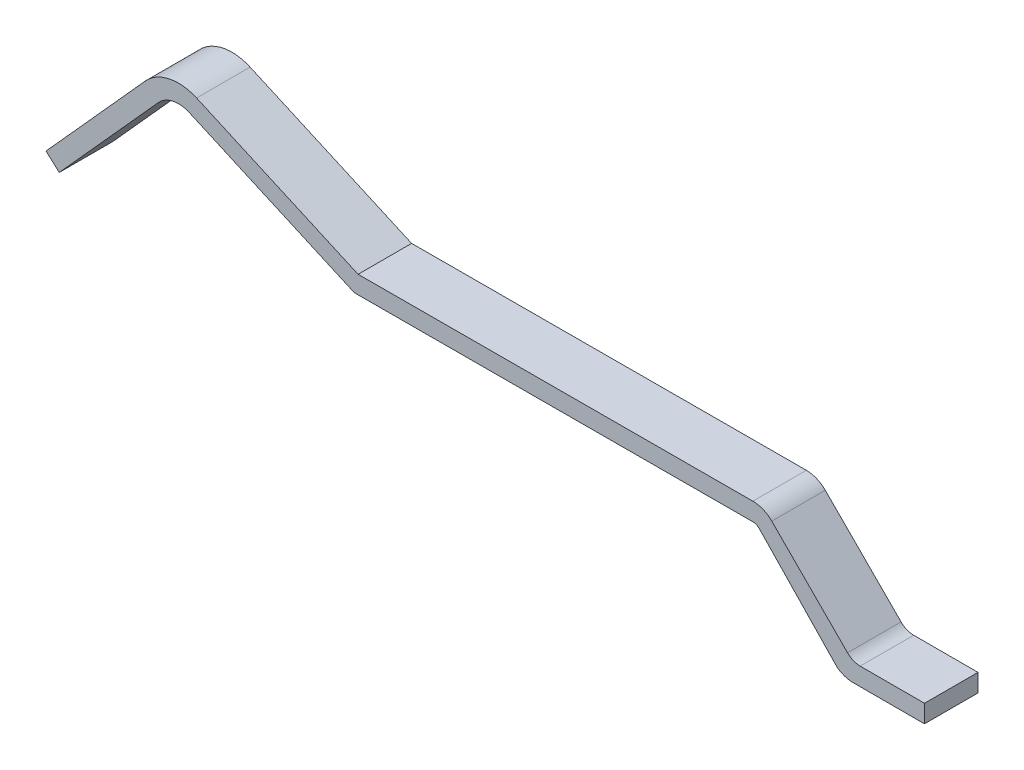
ISO-10303-21;
HEADER;
FILE_DESCRIPTION(('STEP AP214'),'2;1');
FILE_NAME('part.step','',(''),(''),'','','');
FILE_SCHEMA(('AUTOMOTIVE_DESIGN { 1 0 10303 214 1 1 1 1 }'));
ENDSEC;
DATA;
#1=APPLICATION_CONTEXT('core data for automotive mechanical design processes');
#2=APPLICATION_PROTOCOL_DEFINITION('international standard','automotive_design',2000,#1);
#3=PRODUCT_CONTEXT('',#1,'mechanical');
#4=PRODUCT('Part','Part','',(#3));
#5=PRODUCT_RELATED_PRODUCT_CATEGORY('part','',(#4));
#6=PRODUCT_DEFINITION_FORMATION('','',#4);
#7=PRODUCT_DEFINITION_CONTEXT('part definition',#1,'design');
#8=PRODUCT_DEFINITION('design','',#6,#7);
#9=PRODUCT_DEFINITION_SHAPE('','',#8);
#10=(LENGTH_UNIT() NAMED_UNIT(*) SI_UNIT(.MILLI.,.METRE.));
#11=(NAMED_UNIT(*) PLANE_ANGLE_UNIT() SI_UNIT($,.RADIAN.));
#12=(NAMED_UNIT(*) SI_UNIT($,.STERADIAN.) SOLID_ANGLE_UNIT());
#13=UNCERTAINTY_MEASURE_WITH_UNIT(LENGTH_MEASURE(1.E-05),#10,'distance_accuracy_value','');
#14=(GEOMETRIC_REPRESENTATION_CONTEXT(3) GLOBAL_UNCERTAINTY_ASSIGNED_CONTEXT((#13)) GLOBAL_UNIT_ASSIGNED_CONTEXT((#10,
#11,#12)) REPRESENTATION_CONTEXT('',''));
#15=CARTESIAN_POINT('',(0.,0.,0.));
#16=DIRECTION('',(0.,0.,1.));
#17=DIRECTION('',(1.,0.,0.));
#18=AXIS2_PLACEMENT_3D('',#15,#16,#17);
#19=CARTESIAN_POINT('',(18.078994901728,0.200000000000047,0.3));
#20=DIRECTION('',(0.,-1.,0.));
#21=DIRECTION('',(1.,0.,0.));
#22=AXIS2_PLACEMENT_3D('',#19,#20,#21);
#23=PLANE('',#22);
#24=DIRECTION('',(-1.,0.,0.));
#25=VECTOR('',#24,1.);
#26=CARTESIAN_POINT('',(18.078994901728,0.200000000000047,-0.3));
#27=LINE('',#26,#25);
#28=CARTESIAN_POINT('',(18.8,0.200000000000047,-0.3));
#29=VERTEX_POINT('',#28);
#30=CARTESIAN_POINT('',(18.078994901728,0.200000000000047,-0.3));
#31=VERTEX_POINT('',#30);
#32=EDGE_CURVE('E190',#29,#31,#27,.T.);
#33=ORIENTED_EDGE('',*,*,#32,.T.);
#34=DIRECTION('',(0.,0.,-1.));
#35=VECTOR('',#34,1.);
#36=CARTESIAN_POINT('',(18.078994901728,0.200000000000047,0.3));
#37=LINE('',#36,#35);
#38=CARTESIAN_POINT('',(18.078994901728,0.200000000000047,0.3));
#39=VERTEX_POINT('',#38);
#40=EDGE_CURVE('E11',#39,#31,#37,.T.);
#41=ORIENTED_EDGE('',*,*,#40,.F.);
#42=DIRECTION('',(-1.,0.,0.));
#43=VECTOR('',#42,1.);
#44=CARTESIAN_POINT('',(18.078994901728,0.200000000000047,0.3));
#45=LINE('',#44,#43);
#46=CARTESIAN_POINT('',(18.8,0.200000000000047,0.3));
#47=VERTEX_POINT('',#46);
#48=EDGE_CURVE('E224',#47,#39,#45,.T.);
#49=ORIENTED_EDGE('',*,*,#48,.F.);
#50=DIRECTION('',(0.,0.,-1.));
#51=VECTOR('',#50,1.);
#52=CARTESIAN_POINT('',(18.8,0.200000000000047,0.3));
#53=LINE('',#52,#51);
#54=EDGE_CURVE('E186',#47,#29,#53,.T.);
#55=ORIENTED_EDGE('',*,*,#54,.T.);
#56=EDGE_LOOP('',(#33,#41,#49,#55));
#57=FACE_BOUND('',#56,.T.);
#58=ADVANCED_FACE('F34',(#57),#23,.F.);
#59=CARTESIAN_POINT('',(18.078994901728,0.400000000000047,0.3));
#60=DIRECTION('',(0.,0.,-1.));
#61=DIRECTION('',(-1.,0.,0.));
#62=AXIS2_PLACEMENT_3D('',#59,#60,#61);
#63=CYLINDRICAL_SURFACE('',#62,0.2);
#64=CARTESIAN_POINT('',(18.078994901728,0.400000000000047,-0.3));
#65=DIRECTION('',(0.,0.,-1.));
#66=DIRECTION('',(1.,0.,0.));
#67=AXIS2_PLACEMENT_3D('',#64,#65,#66);
#68=CIRCLE('',#67,0.2);
#69=CARTESIAN_POINT('',(17.9372543641692,0.258898547092701,-0.3));
#70=VERTEX_POINT('',#69);
#71=EDGE_CURVE('E193',#31,#70,#68,.T.);
#72=ORIENTED_EDGE('',*,*,#71,.T.);
#73=DIRECTION('',(0.,0.,-1.));
#74=VECTOR('',#73,1.);
#75=CARTESIAN_POINT('',(17.9372543641692,0.258898547092701,0.3));
#76=LINE('',#75,#74);
#77=CARTESIAN_POINT('',(17.9372543641692,0.258898547092701,0.3));
#78=VERTEX_POINT('',#77);
#79=EDGE_CURVE('E42',#78,#70,#76,.T.);
#80=ORIENTED_EDGE('',*,*,#79,.F.);
#81=CARTESIAN_POINT('',(18.078994901728,0.400000000000047,0.3));
#82=DIRECTION('',(0.,0.,-1.));
#83=DIRECTION('',(1.,0.,0.));
#84=AXIS2_PLACEMENT_3D('',#81,#82,#83);
#85=CIRCLE('',#84,0.2);
#86=EDGE_CURVE('E123',#39,#78,#85,.T.);
#87=ORIENTED_EDGE('',*,*,#86,.F.);
#88=ORIENTED_EDGE('',*,*,#40,.T.);
#89=EDGE_LOOP('',(#72,#80,#87,#88));
#90=FACE_BOUND('',#89,.T.);
#91=ADVANCED_FACE('F332',(#90),#63,.F.);
#92=CARTESIAN_POINT('',(17.0878679656441,1.11213203435578,0.3));
#93=DIRECTION('',(-0.708702687793621,-0.705507264536729,0.));
#94=DIRECTION('',(0.705507264536729,-0.708702687793621,0.));
#95=AXIS2_PLACEMENT_3D('',#92,#93,#94);
#96=PLANE('',#95);
#97=DIRECTION('',(-0.705507264536729,0.708702687793621,0.));
#98=VECTOR('',#97,1.);
#99=CARTESIAN_POINT('',(17.0878679656441,1.11213203435578,-0.3));
#100=LINE('',#99,#98);
#101=CARTESIAN_POINT('',(17.0878679656441,1.11213203435578,-0.3));
#102=VERTEX_POINT('',#101);
#103=EDGE_CURVE('E195',#70,#102,#100,.T.);
#104=ORIENTED_EDGE('',*,*,#103,.T.);
#105=DIRECTION('',(0.,0.,-1.));
#106=VECTOR('',#105,1.);
#107=CARTESIAN_POINT('',(17.0878679656441,1.11213203435578,0.3));
#108=LINE('',#107,#106);
#109=CARTESIAN_POINT('',(17.0878679656441,1.11213203435578,0.3));
#110=VERTEX_POINT('',#109);
#111=EDGE_CURVE('E261',#110,#102,#108,.T.);
#112=ORIENTED_EDGE('',*,*,#111,.F.);
#113=DIRECTION('',(-0.705507264536729,0.708702687793621,0.));
#114=VECTOR('',#113,1.);
#115=CARTESIAN_POINT('',(17.0878679656441,1.11213203435578,0.3));
#116=LINE('',#115,#114);
#117=EDGE_CURVE('E269',#78,#110,#116,.T.);
#118=ORIENTED_EDGE('',*,*,#117,.F.);
#119=ORIENTED_EDGE('',*,*,#79,.T.);
#120=EDGE_LOOP('',(#104,#112,#118,#119));
#121=FACE_BOUND('',#120,.T.);
#122=ADVANCED_FACE('F267',(#121),#96,.F.);
#123=CARTESIAN_POINT('',(16.8764101070644,0.901627604302296,0.3));
#124=DIRECTION('',(0.,0.,-1.));
#125=DIRECTION('',(-1.,0.,0.));
#126=AXIS2_PLACEMENT_3D('',#123,#124,#125);
#127=CYLINDRICAL_SURFACE('',#126,0.298373157350417);
#128=CARTESIAN_POINT('',(16.8764101070644,0.901627604302296,-0.3));
#129=DIRECTION('',(0.,0.,1.));
#130=DIRECTION('',(1.,0.,0.));
#131=AXIS2_PLACEMENT_3D('',#128,#129,#130);
#132=CIRCLE('',#131,0.298373157350417);
#133=CARTESIAN_POINT('',(16.8757359312881,1.19999999999982,-0.3));
#134=VERTEX_POINT('',#133);
#135=EDGE_CURVE('E197',#102,#134,#132,.T.);
#136=ORIENTED_EDGE('',*,*,#135,.T.);
#137=DIRECTION('',(0.,0.,-1.));
#138=VECTOR('',#137,1.);
#139=CARTESIAN_POINT('',(16.8757359312881,1.19999999999982,0.3));
#140=LINE('',#139,#138);
#141=CARTESIAN_POINT('',(16.8757359312881,1.19999999999982,0.3));
#142=VERTEX_POINT('',#141);
#143=EDGE_CURVE('E258',#142,#134,#140,.T.);
#144=ORIENTED_EDGE('',*,*,#143,.F.);
#145=CARTESIAN_POINT('',(16.8764101070644,0.901627604302296,0.3));
#146=DIRECTION('',(0.,0.,1.));
#147=DIRECTION('',(1.,0.,0.));
#148=AXIS2_PLACEMENT_3D('',#145,#146,#147);
#149=CIRCLE('',#148,0.298373157350417);
#150=EDGE_CURVE('E287',#110,#142,#149,.T.);
#151=ORIENTED_EDGE('',*,*,#150,.F.);
#152=ORIENTED_EDGE('',*,*,#111,.T.);
#153=EDGE_LOOP('',(#136,#144,#151,#152));
#154=FACE_BOUND('',#153,.T.);
#155=ADVANCED_FACE('F278',(#154),#127,.T.);
#156=CARTESIAN_POINT('',(12.4499999999999,1.19000000000005,0.3));
#157=DIRECTION('',(0.00225950545359492,-0.999997447314295,0.));
#158=DIRECTION('',(0.999997447314295,0.00225950545359492,0.));
#159=AXIS2_PLACEMENT_3D('',#156,#157,#158);
#160=PLANE('',#159);
#161=DIRECTION('',(-0.999997447314295,-0.00225950545359492,0.));
#162=VECTOR('',#161,1.);
#163=CARTESIAN_POINT('',(12.4499999999999,1.19000000000005,-0.3));
#164=LINE('',#163,#162);
#165=CARTESIAN_POINT('',(12.4499999999999,1.19000000000005,-0.3));
#166=VERTEX_POINT('',#165);
#167=EDGE_CURVE('E199',#134,#166,#164,.T.);
#168=ORIENTED_EDGE('',*,*,#167,.T.);
#169=DIRECTION('',(0.,0.,-1.));
#170=VECTOR('',#169,1.);
#171=CARTESIAN_POINT('',(12.4499999999999,1.19000000000005,0.3));
#172=LINE('',#171,#170);
#173=CARTESIAN_POINT('',(12.4499999999999,1.19000000000005,0.3));
#174=VERTEX_POINT('',#173);
#175=EDGE_CURVE('E255',#174,#166,#172,.T.);
#176=ORIENTED_EDGE('',*,*,#175,.F.);
#177=DIRECTION('',(-0.999997447314295,-0.00225950545359492,0.));
#178=VECTOR('',#177,1.);
#179=CARTESIAN_POINT('',(12.4499999999999,1.19000000000005,0.3));
#180=LINE('',#179,#178);
#181=EDGE_CURVE('E284',#142,#174,#180,.T.);
#182=ORIENTED_EDGE('',*,*,#181,.F.);
#183=ORIENTED_EDGE('',*,*,#143,.T.);
#184=EDGE_LOOP('',(#168,#176,#182,#183));
#185=FACE_BOUND('',#184,.T.);
#186=ADVANCED_FACE('F282',(#185),#160,.F.);
#187=CARTESIAN_POINT('',(10.6393188810586,1.9961671740989,0.3));
#188=DIRECTION('',(-0.40673664307565,-0.913545457642668,0.));
#189=DIRECTION('',(0.913545457642668,-0.40673664307565,0.));
#190=AXIS2_PLACEMENT_3D('',#187,#188,#189);
#191=PLANE('',#190);
#192=DIRECTION('',(-0.913545457642668,0.40673664307565,0.));
#193=VECTOR('',#192,1.);
#194=CARTESIAN_POINT('',(10.6393188810586,1.9961671740989,-0.3));
#195=LINE('',#194,#193);
#196=CARTESIAN_POINT('',(10.6393188810586,1.9961671740989,-0.3));
#197=VERTEX_POINT('',#196);
#198=EDGE_CURVE('E201',#166,#197,#195,.T.);
#199=ORIENTED_EDGE('',*,*,#198,.T.);
#200=DIRECTION('',(0.,0.,-1.));
#201=VECTOR('',#200,1.);
#202=CARTESIAN_POINT('',(10.6393188810586,1.9961671740989,0.3));
#203=LINE('',#202,#201);
#204=CARTESIAN_POINT('',(10.6393188810586,1.9961671740989,0.3));
#205=VERTEX_POINT('',#204);
#206=EDGE_CURVE('E252',#205,#197,#203,.T.);
#207=ORIENTED_EDGE('',*,*,#206,.F.);
#208=DIRECTION('',(-0.913545457642668,0.40673664307565,0.));
#209=VECTOR('',#208,1.);
#210=CARTESIAN_POINT('',(10.6393188810586,1.9961671740989,0.3));
#211=LINE('',#210,#209);
#212=EDGE_CURVE('E286',#174,#205,#211,.T.);
#213=ORIENTED_EDGE('',*,*,#212,.F.);
#214=ORIENTED_EDGE('',*,*,#175,.T.);
#215=EDGE_LOOP('',(#199,#207,#213,#214));
#216=FACE_BOUND('',#215,.T.);
#217=ADVANCED_FACE('F345',(#216),#191,.F.);
#218=CARTESIAN_POINT('',(10.4359505595208,1.53939444527736,0.3));
#219=DIRECTION('',(0.,0.,-1.));
#220=DIRECTION('',(-1.,0.,0.));
#221=AXIS2_PLACEMENT_3D('',#218,#219,#220);
#222=CYLINDRICAL_SURFACE('',#221,0.50000000000019);
#223=CARTESIAN_POINT('',(10.4359505595208,1.53939444527736,-0.3));
#224=DIRECTION('',(0.,0.,1.));
#225=DIRECTION('',(1.,0.,0.));
#226=AXIS2_PLACEMENT_3D('',#223,#224,#225);
#227=CIRCLE('',#226,0.50000000000019);
#228=CARTESIAN_POINT('',(10.0643781467819,1.87395974845692,-0.3));
#229=VERTEX_POINT('',#228);
#230=EDGE_CURVE('E203',#197,#229,#227,.T.);
#231=ORIENTED_EDGE('',*,*,#230,.T.);
#232=DIRECTION('',(0.,0.,-1.));
#233=VECTOR('',#232,1.);
#234=CARTESIAN_POINT('',(10.0643781467819,1.87395974845692,0.3));
#235=LINE('',#234,#233);
#236=CARTESIAN_POINT('',(10.0643781467819,1.87395974845692,0.3));
#237=VERTEX_POINT('',#236);
#238=EDGE_CURVE('E249',#237,#229,#235,.T.);
#239=ORIENTED_EDGE('',*,*,#238,.F.);
#240=CARTESIAN_POINT('',(10.4359505595208,1.53939444527736,0.3));
#241=DIRECTION('',(0.,0.,1.));
#242=DIRECTION('',(1.,0.,0.));
#243=AXIS2_PLACEMENT_3D('',#240,#241,#242);
#244=CIRCLE('',#243,0.50000000000019);
#245=EDGE_CURVE('E289',#205,#237,#244,.T.);
#246=ORIENTED_EDGE('',*,*,#245,.F.);
#247=ORIENTED_EDGE('',*,*,#206,.T.);
#248=EDGE_LOOP('',(#231,#239,#246,#247));
#249=FACE_BOUND('',#248,.T.);
#250=ADVANCED_FACE('F348',(#249),#222,.T.);
#251=CARTESIAN_POINT('',(8.95090286046869,0.63732016052452,0.3));
#252=DIRECTION('',(0.743144825477361,-0.669130606358895,0.));
#253=DIRECTION('',(0.669130606358895,0.743144825477361,0.));
#254=AXIS2_PLACEMENT_3D('',#251,#252,#253);
#255=PLANE('',#254);
#256=DIRECTION('',(-0.669130606358895,-0.743144825477361,0.));
#257=VECTOR('',#256,1.);
#258=CARTESIAN_POINT('',(8.95090286046869,0.63732016052452,-0.3));
#259=LINE('',#258,#257);
#260=CARTESIAN_POINT('',(8.95090286046869,0.63732016052452,-0.3));
#261=VERTEX_POINT('',#260);
#262=EDGE_CURVE('E205',#229,#261,#259,.T.);
#263=ORIENTED_EDGE('',*,*,#262,.T.);
#264=DIRECTION('',(0.,0.,-1.));
#265=VECTOR('',#264,1.);
#266=CARTESIAN_POINT('',(8.95090286046869,0.63732016052452,0.3));
#267=LINE('',#266,#265);
#268=CARTESIAN_POINT('',(8.95090286046869,0.63732016052452,0.3));
#269=VERTEX_POINT('',#268);
#270=EDGE_CURVE('E246',#269,#261,#267,.T.);
#271=ORIENTED_EDGE('',*,*,#270,.F.);
#272=DIRECTION('',(-0.669130606358895,-0.743144825477361,0.));
#273=VECTOR('',#272,1.);
#274=CARTESIAN_POINT('',(8.95090286046869,0.63732016052452,0.3));
#275=LINE('',#274,#273);
#276=EDGE_CURVE('E295',#237,#269,#275,.T.);
#277=ORIENTED_EDGE('',*,*,#276,.F.);
#278=ORIENTED_EDGE('',*,*,#238,.T.);
#279=EDGE_LOOP('',(#263,#271,#277,#278));
#280=FACE_BOUND('',#279,.T.);
#281=ADVANCED_FACE('F352',(#280),#255,.F.);
#282=CARTESIAN_POINT('',(9.09953182556442,0.503494039252559,0.3));
#283=DIRECTION('',(0.669130606358746,0.743144825477495,0.));
#284=DIRECTION('',(-0.743144825477495,0.669130606358746,0.));
#285=AXIS2_PLACEMENT_3D('',#282,#283,#284);
#286=PLANE('',#285);
#287=DIRECTION('',(0.743144825477495,-0.669130606358746,0.));
#288=VECTOR('',#287,1.);
#289=CARTESIAN_POINT('',(9.09953182556442,0.503494039252559,-0.3));
#290=LINE('',#289,#288);
#291=CARTESIAN_POINT('',(9.09953182556442,0.503494039252559,-0.3));
#292=VERTEX_POINT('',#291);
#293=EDGE_CURVE('E207',#261,#292,#290,.T.);
#294=ORIENTED_EDGE('',*,*,#293,.T.);
#295=DIRECTION('',(0.,0.,-1.));
#296=VECTOR('',#295,1.);
#297=CARTESIAN_POINT('',(9.09953182556442,0.503494039252559,0.3));
#298=LINE('',#297,#296);
#299=CARTESIAN_POINT('',(9.09953182556442,0.503494039252559,0.3));
#300=VERTEX_POINT('',#299);
#301=EDGE_CURVE('E243',#300,#292,#298,.T.);
#302=ORIENTED_EDGE('',*,*,#301,.F.);
#303=DIRECTION('',(0.743144825477495,-0.669130606358746,0.));
#304=VECTOR('',#303,1.);
#305=CARTESIAN_POINT('',(9.09953182556442,0.503494039252559,0.3));
#306=LINE('',#305,#304);
#307=EDGE_CURVE('E297',#269,#300,#306,.T.);
#308=ORIENTED_EDGE('',*,*,#307,.F.);
#309=ORIENTED_EDGE('',*,*,#270,.T.);
#310=EDGE_LOOP('',(#294,#302,#308,#309));
#311=FACE_BOUND('',#310,.T.);
#312=ADVANCED_FACE('F356',(#311),#286,.F.);
#313=CARTESIAN_POINT('',(10.2130071118774,1.74013362718514,0.3));
#314=DIRECTION('',(-0.743144825477495,0.669130606358746,0.));
#315=DIRECTION('',(-0.669130606358746,-0.743144825477495,0.));
#316=AXIS2_PLACEMENT_3D('',#313,#314,#315);
#317=PLANE('',#316);
#318=DIRECTION('',(0.669130606358746,0.743144825477495,0.));
#319=VECTOR('',#318,1.);
#320=CARTESIAN_POINT('',(10.2130071118774,1.74013362718514,-0.3));
#321=LINE('',#320,#319);
#322=CARTESIAN_POINT('',(10.2130071118774,1.74013362718514,-0.3));
#323=VERTEX_POINT('',#322);
#324=EDGE_CURVE('E209',#292,#323,#321,.T.);
#325=ORIENTED_EDGE('',*,*,#324,.T.);
#326=DIRECTION('',(0.,0.,-1.));
#327=VECTOR('',#326,1.);
#328=CARTESIAN_POINT('',(10.2130071118774,1.74013362718514,0.3));
#329=LINE('',#328,#327);
#330=CARTESIAN_POINT('',(10.2130071118774,1.74013362718514,0.3));
#331=VERTEX_POINT('',#330);
#332=EDGE_CURVE('E240',#331,#323,#329,.T.);
#333=ORIENTED_EDGE('',*,*,#332,.F.);
#334=DIRECTION('',(0.669130606358746,0.743144825477495,0.));
#335=VECTOR('',#334,1.);
#336=CARTESIAN_POINT('',(10.2130071118774,1.74013362718514,0.3));
#337=LINE('',#336,#335);
#338=EDGE_CURVE('E299',#300,#331,#337,.T.);
#339=ORIENTED_EDGE('',*,*,#338,.F.);
#340=ORIENTED_EDGE('',*,*,#301,.T.);
#341=EDGE_LOOP('',(#325,#333,#339,#340));
#342=FACE_BOUND('',#341,.T.);
#343=ADVANCED_FACE('F360',(#342),#317,.F.);
#344=CARTESIAN_POINT('',(10.4359505595208,1.53939444527741,0.3));
#345=DIRECTION('',(0.,0.,-1.));
#346=DIRECTION('',(-1.,0.,0.));
#347=AXIS2_PLACEMENT_3D('',#344,#345,#346);
#348=CYLINDRICAL_SURFACE('',#347,0.300000000000162);
#349=CARTESIAN_POINT('',(10.4359505595208,1.53939444527741,-0.3));
#350=DIRECTION('',(0.,0.,-1.));
#351=DIRECTION('',(1.,0.,0.));
#352=AXIS2_PLACEMENT_3D('',#349,#350,#351);
#353=CIRCLE('',#352,0.300000000000162);
#354=CARTESIAN_POINT('',(10.5579715524435,1.81345808257036,-0.3));
#355=VERTEX_POINT('',#354);
#356=EDGE_CURVE('E211',#323,#355,#353,.T.);
#357=ORIENTED_EDGE('',*,*,#356,.T.);
#358=DIRECTION('',(0.,0.,-1.));
#359=VECTOR('',#358,1.);
#360=CARTESIAN_POINT('',(10.5579715524435,1.81345808257036,0.3));
#361=LINE('',#360,#359);
#362=CARTESIAN_POINT('',(10.5579715524435,1.81345808257036,0.3));
#363=VERTEX_POINT('',#362);
#364=EDGE_CURVE('E237',#363,#355,#361,.T.);
#365=ORIENTED_EDGE('',*,*,#364,.F.);
#366=CARTESIAN_POINT('',(10.4359505595208,1.53939444527741,0.3));
#367=DIRECTION('',(0.,0.,-1.));
#368=DIRECTION('',(1.,0.,0.));
#369=AXIS2_PLACEMENT_3D('',#366,#367,#368);
#370=CIRCLE('',#369,0.300000000000162);
#371=EDGE_CURVE('E301',#331,#363,#370,.T.);
#372=ORIENTED_EDGE('',*,*,#371,.F.);
#373=ORIENTED_EDGE('',*,*,#332,.T.);
#374=EDGE_LOOP('',(#357,#365,#372,#373));
#375=FACE_BOUND('',#374,.T.);
#376=ADVANCED_FACE('F364',(#375),#348,.F.);
#377=CARTESIAN_POINT('',(12.407488687666,0.99,0.3));
#378=DIRECTION('',(0.40673664307565,0.913545457642667,0.));
#379=DIRECTION('',(-0.913545457642668,0.40673664307565,0.));
#380=AXIS2_PLACEMENT_3D('',#377,#378,#379);
#381=PLANE('',#380);
#382=DIRECTION('',(0.913545457642668,-0.40673664307565,0.));
#383=VECTOR('',#382,1.);
#384=CARTESIAN_POINT('',(12.407488687666,0.99,-0.3));
#385=LINE('',#384,#383);
#386=CARTESIAN_POINT('',(12.407488687666,0.99,-0.3));
#387=VERTEX_POINT('',#386);
#388=EDGE_CURVE('E213',#355,#387,#385,.T.);
#389=ORIENTED_EDGE('',*,*,#388,.T.);
#390=DIRECTION('',(0.,0.,-1.));
#391=VECTOR('',#390,1.);
#392=CARTESIAN_POINT('',(12.407488687666,0.99,0.3));
#393=LINE('',#392,#391);
#394=CARTESIAN_POINT('',(12.407488687666,0.99,0.3));
#395=VERTEX_POINT('',#394);
#396=EDGE_CURVE('E234',#395,#387,#393,.T.);
#397=ORIENTED_EDGE('',*,*,#396,.F.);
#398=DIRECTION('',(0.913545457642668,-0.40673664307565,0.));
#399=VECTOR('',#398,1.);
#400=CARTESIAN_POINT('',(12.407488687666,0.99,0.3));
#401=LINE('',#400,#399);
#402=EDGE_CURVE('E303',#363,#395,#401,.T.);
#403=ORIENTED_EDGE('',*,*,#402,.F.);
#404=ORIENTED_EDGE('',*,*,#364,.T.);
#405=EDGE_LOOP('',(#389,#397,#403,#404));
#406=FACE_BOUND('',#405,.T.);
#407=ADVANCED_FACE('F368',(#406),#381,.F.);
#408=CARTESIAN_POINT('',(16.8757359312874,1.00000000000006,0.3));
#409=DIRECTION('',(-0.00223800842061619,0.999997495656019,0.));
#410=DIRECTION('',(-0.999997495656019,-0.00223800842061619,0.));
#411=AXIS2_PLACEMENT_3D('',#408,#409,#410);
#412=PLANE('',#411);
#413=DIRECTION('',(0.999997495656019,0.00223800842061619,0.));
#414=VECTOR('',#413,1.);
#415=CARTESIAN_POINT('',(16.8757359312874,1.00000000000006,-0.3));
#416=LINE('',#415,#414);
#417=CARTESIAN_POINT('',(16.8757359312874,1.00000000000004,-0.3));
#418=VERTEX_POINT('',#417);
#419=EDGE_CURVE('E215',#387,#418,#416,.T.);
#420=ORIENTED_EDGE('',*,*,#419,.T.);
#421=DIRECTION('',(0.,0.,-1.));
#422=VECTOR('',#421,1.);
#423=CARTESIAN_POINT('',(16.8757359312874,1.00000000000004,0.3));
#424=LINE('',#423,#422);
#425=CARTESIAN_POINT('',(16.8757359312874,1.00000000000004,0.3));
#426=VERTEX_POINT('',#425);
#427=EDGE_CURVE('E231',#426,#418,#424,.T.);
#428=ORIENTED_EDGE('',*,*,#427,.F.);
#429=DIRECTION('',(0.999997495656019,0.00223800842061619,0.));
#430=VECTOR('',#429,1.);
#431=CARTESIAN_POINT('',(16.8757359312874,1.00000000000006,0.3));
#432=LINE('',#431,#430);
#433=EDGE_CURVE('E305',#395,#426,#432,.T.);
#434=ORIENTED_EDGE('',*,*,#433,.F.);
#435=ORIENTED_EDGE('',*,*,#396,.T.);
#436=EDGE_LOOP('',(#420,#428,#434,#435));
#437=FACE_BOUND('',#436,.T.);
#438=ADVANCED_FACE('F372',(#437),#412,.F.);
#439=CARTESIAN_POINT('',(16.8759585299795,0.900537400779785,0.3));
#440=DIRECTION('',(0.,0.,-1.));
#441=DIRECTION('',(-1.,0.,0.));
#442=AXIS2_PLACEMENT_3D('',#439,#440,#441);
#443=CYLINDRICAL_SURFACE('',#442,0.0994628483094401);
#444=CARTESIAN_POINT('',(16.8759585299795,0.900537400779785,-0.3));
#445=DIRECTION('',(0.,0.,-1.));
#446=DIRECTION('',(-1.,0.,0.));
#447=AXIS2_PLACEMENT_3D('',#444,#445,#446);
#448=CIRCLE('',#447,0.0994628483094401);
#449=CARTESIAN_POINT('',(16.9464466094068,0.970710678118623,-0.3));
#450=VERTEX_POINT('',#449);
#451=EDGE_CURVE('E217',#418,#450,#448,.T.);
#452=ORIENTED_EDGE('',*,*,#451,.T.);
#453=DIRECTION('',(0.,0.,-1.));
#454=VECTOR('',#453,1.);
#455=CARTESIAN_POINT('',(16.9464466094068,0.970710678118623,0.3));
#456=LINE('',#455,#454);
#457=CARTESIAN_POINT('',(16.9464466094068,0.970710678118623,0.3));
#458=VERTEX_POINT('',#457);
#459=EDGE_CURVE('E228',#458,#450,#456,.T.);
#460=ORIENTED_EDGE('',*,*,#459,.F.);
#461=CARTESIAN_POINT('',(16.8759585299795,0.900537400779785,0.3));
#462=DIRECTION('',(0.,0.,-1.));
#463=DIRECTION('',(-1.,0.,0.));
#464=AXIS2_PLACEMENT_3D('',#461,#462,#463);
#465=CIRCLE('',#464,0.0994628483094401);
#466=EDGE_CURVE('E307',#426,#458,#465,.T.);
#467=ORIENTED_EDGE('',*,*,#466,.F.);
#468=ORIENTED_EDGE('',*,*,#427,.T.);
#469=EDGE_LOOP('',(#452,#460,#467,#468));
#470=FACE_BOUND('',#469,.T.);
#471=ADVANCED_FACE('F313',(#470),#443,.F.);
#472=CARTESIAN_POINT('',(17.82,0.0599999999999465,0.3));
#473=DIRECTION('',(0.721675803920417,0.692231199842813,0.));
#474=DIRECTION('',(-0.692231199842813,0.721675803920417,0.));
#475=AXIS2_PLACEMENT_3D('',#472,#473,#474);
#476=PLANE('',#475);
#477=DIRECTION('',(0.692231199842813,-0.721675803920417,0.));
#478=VECTOR('',#477,1.);
#479=CARTESIAN_POINT('',(17.82,0.0599999999999465,-0.3));
#480=LINE('',#479,#478);
#481=CARTESIAN_POINT('',(17.82,0.0599999999999465,-0.3));
#482=VERTEX_POINT('',#481);
#483=EDGE_CURVE('E219',#450,#482,#480,.T.);
#484=ORIENTED_EDGE('',*,*,#483,.T.);
#485=DIRECTION('',(0.,0.,-1.));
#486=VECTOR('',#485,1.);
#487=CARTESIAN_POINT('',(17.82,0.0599999999999465,0.3));
#488=LINE('',#487,#486);
#489=CARTESIAN_POINT('',(17.82,0.0599999999999465,0.3));
#490=VERTEX_POINT('',#489);
#491=EDGE_CURVE('E181',#490,#482,#488,.T.);
#492=ORIENTED_EDGE('',*,*,#491,.F.);
#493=DIRECTION('',(0.692231199842813,-0.721675803920417,0.));
#494=VECTOR('',#493,1.);
#495=CARTESIAN_POINT('',(17.82,0.0599999999999465,0.3));
#496=LINE('',#495,#494);
#497=EDGE_CURVE('E172',#458,#490,#496,.T.);
#498=ORIENTED_EDGE('',*,*,#497,.F.);
#499=ORIENTED_EDGE('',*,*,#459,.T.);
#500=EDGE_LOOP('',(#484,#492,#498,#499));
#501=FACE_BOUND('',#500,.T.);
#502=ADVANCED_FACE('F317',(#501),#476,.F.);
#503=CARTESIAN_POINT('',(18.,0.300000000000376,0.3));
#504=DIRECTION('',(0.,0.,-1.));
#505=DIRECTION('',(-1.,0.,0.));
#506=AXIS2_PLACEMENT_3D('',#503,#504,#505);
#507=CYLINDRICAL_SURFACE('',#506,0.300000000000358);
#508=CARTESIAN_POINT('',(18.,0.300000000000376,-0.3));
#509=DIRECTION('',(0.,0.,1.));
#510=DIRECTION('',(-1.,0.,0.));
#511=AXIS2_PLACEMENT_3D('',#508,#509,#510);
#512=CIRCLE('',#511,0.300000000000358);
#513=CARTESIAN_POINT('',(18.,0.,-0.3));
#514=VERTEX_POINT('',#513);
#515=EDGE_CURVE('E180',#482,#514,#512,.T.);
#516=ORIENTED_EDGE('',*,*,#515,.T.);
#517=DIRECTION('',(0.,0.,-1.));
#518=VECTOR('',#517,1.);
#519=CARTESIAN_POINT('',(18.,0.,0.3));
#520=LINE('',#519,#518);
#521=CARTESIAN_POINT('',(18.,0.,0.3));
#522=VERTEX_POINT('',#521);
#523=EDGE_CURVE('E177',#522,#514,#520,.T.);
#524=ORIENTED_EDGE('',*,*,#523,.F.);
#525=CARTESIAN_POINT('',(18.,0.300000000000376,0.3));
#526=DIRECTION('',(0.,0.,1.));
#527=DIRECTION('',(-1.,0.,0.));
#528=AXIS2_PLACEMENT_3D('',#525,#526,#527);
#529=CIRCLE('',#528,0.300000000000358);
#530=EDGE_CURVE('E166',#490,#522,#529,.T.);
#531=ORIENTED_EDGE('',*,*,#530,.F.);
#532=ORIENTED_EDGE('',*,*,#491,.T.);
#533=EDGE_LOOP('',(#516,#524,#531,#532));
#534=FACE_BOUND('',#533,.T.);
#535=ADVANCED_FACE('F178',(#534),#507,.T.);
#536=CARTESIAN_POINT('',(18.8,0.,0.3));
#537=DIRECTION('',(0.,1.,0.));
#538=DIRECTION('',(-1.,0.,0.));
#539=AXIS2_PLACEMENT_3D('',#536,#537,#538);
#540=PLANE('',#539);
#541=DIRECTION('',(1.,0.,0.));
#542=VECTOR('',#541,1.);
#543=CARTESIAN_POINT('',(18.8,0.,-0.3));
#544=LINE('',#543,#542);
#545=CARTESIAN_POINT('',(18.8,0.,-0.3));
#546=VERTEX_POINT('',#545);
#547=EDGE_CURVE('E109',#514,#546,#544,.T.);
#548=ORIENTED_EDGE('',*,*,#547,.T.);
#549=DIRECTION('',(0.,0.,-1.));
#550=VECTOR('',#549,1.);
#551=CARTESIAN_POINT('',(18.8,0.,0.3));
#552=LINE('',#551,#550);
#553=CARTESIAN_POINT('',(18.8,0.,0.3));
#554=VERTEX_POINT('',#553);
#555=EDGE_CURVE('E182',#554,#546,#552,.T.);
#556=ORIENTED_EDGE('',*,*,#555,.F.);
#557=DIRECTION('',(1.,0.,0.));
#558=VECTOR('',#557,1.);
#559=CARTESIAN_POINT('',(18.8,0.,0.3));
#560=LINE('',#559,#558);
#561=EDGE_CURVE('E170',#522,#554,#560,.T.);
#562=ORIENTED_EDGE('',*,*,#561,.F.);
#563=ORIENTED_EDGE('',*,*,#523,.T.);
#564=EDGE_LOOP('',(#548,#556,#562,#563));
#565=FACE_BOUND('',#564,.T.);
#566=ADVANCED_FACE('F184',(#565),#540,.F.);
#567=CARTESIAN_POINT('',(18.8,0.200000000000047,0.3));
#568=DIRECTION('',(-1.,0.,0.));
#569=DIRECTION('',(0.,0.,1.));
#570=AXIS2_PLACEMENT_3D('',#567,#568,#569);
#571=PLANE('',#570);
#572=DIRECTION('',(0.,1.,0.));
#573=VECTOR('',#572,1.);
#574=CARTESIAN_POINT('',(18.8,0.200000000000047,-0.3));
#575=LINE('',#574,#573);
#576=EDGE_CURVE('E115',#546,#29,#575,.T.);
#577=ORIENTED_EDGE('',*,*,#576,.T.);
#578=ORIENTED_EDGE('',*,*,#54,.F.);
#579=DIRECTION('',(0.,1.,0.));
#580=VECTOR('',#579,1.);
#581=CARTESIAN_POINT('',(18.8,0.200000000000047,0.3));
#582=LINE('',#581,#580);
#583=EDGE_CURVE('E50',#554,#47,#582,.T.);
#584=ORIENTED_EDGE('',*,*,#583,.F.);
#585=ORIENTED_EDGE('',*,*,#555,.T.);
#586=EDGE_LOOP('',(#577,#578,#584,#585));
#587=FACE_BOUND('',#586,.T.);
#588=ADVANCED_FACE('F321',(#587),#571,.F.);
#589=CARTESIAN_POINT('',(18.,0.300000000000376,0.3));
#590=DIRECTION('',(0.,0.,-1.));
#591=DIRECTION('',(-1.,0.,0.));
#592=AXIS2_PLACEMENT_3D('',#589,#590,#591);
#593=PLANE('',#592);
#594=ORIENTED_EDGE('',*,*,#48,.T.);
#595=ORIENTED_EDGE('',*,*,#86,.T.);
#596=ORIENTED_EDGE('',*,*,#117,.T.);
#597=ORIENTED_EDGE('',*,*,#150,.T.);
#598=ORIENTED_EDGE('',*,*,#181,.T.);
#599=ORIENTED_EDGE('',*,*,#212,.T.);
#600=ORIENTED_EDGE('',*,*,#245,.T.);
#601=ORIENTED_EDGE('',*,*,#276,.T.);
#602=ORIENTED_EDGE('',*,*,#307,.T.);
#603=ORIENTED_EDGE('',*,*,#338,.T.);
#604=ORIENTED_EDGE('',*,*,#371,.T.);
#605=ORIENTED_EDGE('',*,*,#402,.T.);
#606=ORIENTED_EDGE('',*,*,#433,.T.);
#607=ORIENTED_EDGE('',*,*,#466,.T.);
#608=ORIENTED_EDGE('',*,*,#497,.T.);
#609=ORIENTED_EDGE('',*,*,#530,.T.);
#610=ORIENTED_EDGE('',*,*,#561,.T.);
#611=ORIENTED_EDGE('',*,*,#583,.T.);
#612=EDGE_LOOP('',(#594,#595,#596,#597,#598,#599,#600,#601,#602,#603,#604,#605,#606,#607,#608,
#609,#610,#611));
#613=FACE_BOUND('',#612,.T.);
#614=ADVANCED_FACE('F168',(#613),#593,.F.);
#615=CARTESIAN_POINT('',(18.,0.300000000000376,-0.3));
#616=DIRECTION('',(0.,0.,-1.));
#617=DIRECTION('',(-1.,0.,0.));
#618=AXIS2_PLACEMENT_3D('',#615,#616,#617);
#619=PLANE('',#618);
#620=ORIENTED_EDGE('',*,*,#32,.F.);
#621=ORIENTED_EDGE('',*,*,#576,.F.);
#622=ORIENTED_EDGE('',*,*,#547,.F.);
#623=ORIENTED_EDGE('',*,*,#515,.F.);
#624=ORIENTED_EDGE('',*,*,#483,.F.);
#625=ORIENTED_EDGE('',*,*,#451,.F.);
#626=ORIENTED_EDGE('',*,*,#419,.F.);
#627=ORIENTED_EDGE('',*,*,#388,.F.);
#628=ORIENTED_EDGE('',*,*,#356,.F.);
#629=ORIENTED_EDGE('',*,*,#324,.F.);
#630=ORIENTED_EDGE('',*,*,#293,.F.);
#631=ORIENTED_EDGE('',*,*,#262,.F.);
#632=ORIENTED_EDGE('',*,*,#230,.F.);
#633=ORIENTED_EDGE('',*,*,#198,.F.);
#634=ORIENTED_EDGE('',*,*,#167,.F.);
#635=ORIENTED_EDGE('',*,*,#135,.F.);
#636=ORIENTED_EDGE('',*,*,#103,.F.);
#637=ORIENTED_EDGE('',*,*,#71,.F.);
#638=EDGE_LOOP('',(#620,#621,#622,#623,#624,#625,#626,#627,#628,#629,#630,#631,#632,#633,#634,
#635,#636,#637));
#639=FACE_BOUND('',#638,.T.);
#640=ADVANCED_FACE('F273',(#639),#619,.T.);
#641=CLOSED_SHELL('',(#58,#91,#122,#155,#186,#217,#250,#281,#312,#343,#376,#407,#438,#471,#502,
#535,#566,#588,#614,#640));
#642=MANIFOLD_SOLID_BREP('B2',#641);
#643=ADVANCED_BREP_SHAPE_REPRESENTATION('',(#18,#642),#14);
#644=SHAPE_DEFINITION_REPRESENTATION(#9,#643);
ENDSEC;
END-ISO-10303-21;
